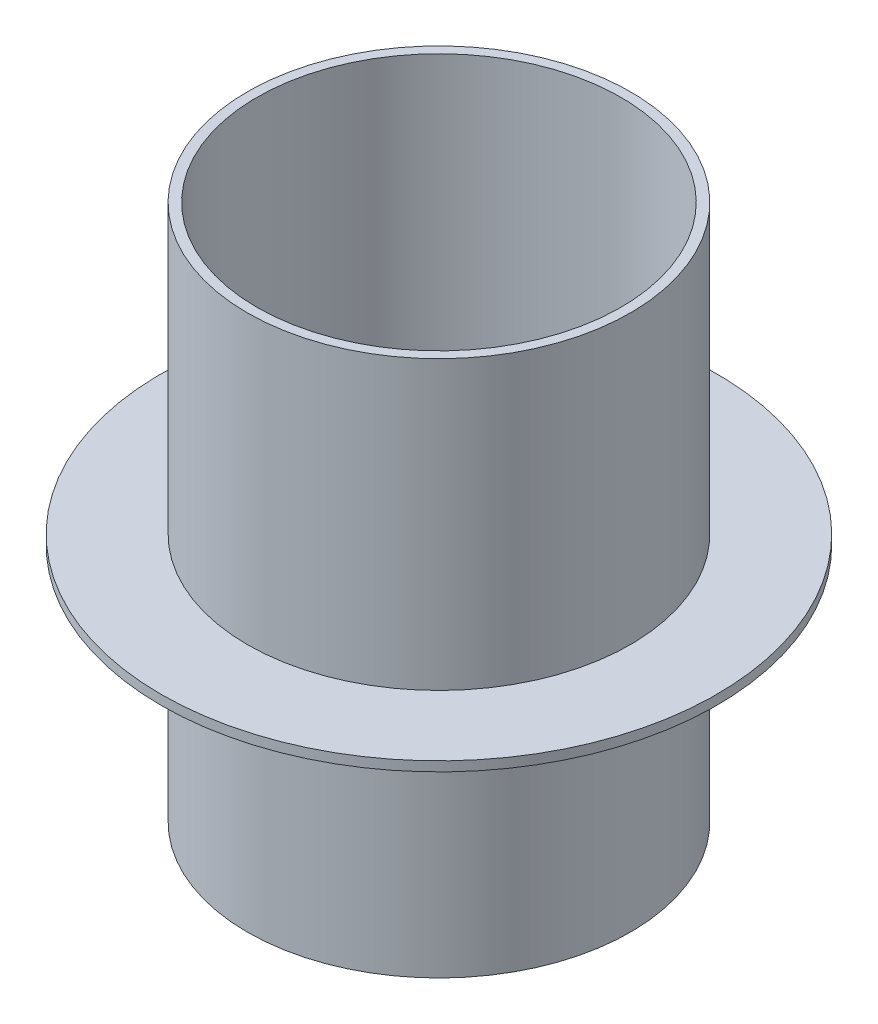
ISO-10303-21;
HEADER;
FILE_DESCRIPTION(('STEP AP214'),'2;1');
FILE_NAME('part.step','',(''),(''),'','','');
FILE_SCHEMA(('AUTOMOTIVE_DESIGN { 1 0 10303 214 1 1 1 1 }'));
ENDSEC;
DATA;
#1=APPLICATION_CONTEXT('core data for automotive mechanical design processes');
#2=APPLICATION_PROTOCOL_DEFINITION('international standard','automotive_design',2000,#1);
#3=PRODUCT_CONTEXT('',#1,'mechanical');
#4=PRODUCT('Part','Part','',(#3));
#5=PRODUCT_RELATED_PRODUCT_CATEGORY('part','',(#4));
#6=PRODUCT_DEFINITION_FORMATION('','',#4);
#7=PRODUCT_DEFINITION_CONTEXT('part definition',#1,'design');
#8=PRODUCT_DEFINITION('design','',#6,#7);
#9=PRODUCT_DEFINITION_SHAPE('','',#8);
#10=(LENGTH_UNIT() NAMED_UNIT(*) SI_UNIT(.MILLI.,.METRE.));
#11=(NAMED_UNIT(*) PLANE_ANGLE_UNIT() SI_UNIT($,.RADIAN.));
#12=(NAMED_UNIT(*) SI_UNIT($,.STERADIAN.) SOLID_ANGLE_UNIT());
#13=UNCERTAINTY_MEASURE_WITH_UNIT(LENGTH_MEASURE(1.E-05),#10,'distance_accuracy_value','');
#14=(GEOMETRIC_REPRESENTATION_CONTEXT(3) GLOBAL_UNCERTAINTY_ASSIGNED_CONTEXT((#13)) GLOBAL_UNIT_ASSIGNED_CONTEXT((#10,
#11,#12)) REPRESENTATION_CONTEXT('',''));
#15=CARTESIAN_POINT('',(0.,0.,0.));
#16=DIRECTION('',(0.,0.,1.));
#17=DIRECTION('',(1.,0.,0.));
#18=AXIS2_PLACEMENT_3D('',#15,#16,#17);
#19=CARTESIAN_POINT('',(38.,112.,0.));
#20=DIRECTION('',(0.,-1.,0.));
#21=DIRECTION('',(0.,0.,-1.));
#22=AXIS2_PLACEMENT_3D('',#19,#20,#21);
#23=PLANE('',#22);
#24=CARTESIAN_POINT('',(0.,112.,0.));
#25=DIRECTION('',(0.,1.,0.));
#26=DIRECTION('',(0.,0.,1.));
#27=AXIS2_PLACEMENT_3D('',#24,#25,#26);
#28=CIRCLE('',#27,38.);
#29=CARTESIAN_POINT('',(0.,112.,38.));
#30=VERTEX_POINT('',#29);
#31=EDGE_CURVE('E60',#30,#30,#28,.T.);
#32=ORIENTED_EDGE('',*,*,#31,.F.);
#33=EDGE_LOOP('',(#32));
#34=FACE_BOUND('',#33,.T.);
#35=CARTESIAN_POINT('',(0.,112.,0.));
#36=DIRECTION('',(0.,1.,0.));
#37=DIRECTION('',(0.,0.,1.));
#38=AXIS2_PLACEMENT_3D('',#35,#36,#37);
#39=CIRCLE('',#38,40.);
#40=CARTESIAN_POINT('',(0.,112.,40.));
#41=VERTEX_POINT('',#40);
#42=EDGE_CURVE('E10',#41,#41,#39,.T.);
#43=ORIENTED_EDGE('',*,*,#42,.T.);
#44=EDGE_LOOP('',(#43));
#45=FACE_BOUND('',#44,.T.);
#46=ADVANCED_FACE('F32',(#34,#45),#23,.F.);
#47=CARTESIAN_POINT('',(0.,71.2247582960843,0.));
#48=DIRECTION('',(0.,1.,0.));
#49=DIRECTION('',(0.,0.,1.));
#50=AXIS2_PLACEMENT_3D('',#47,#48,#49);
#51=CYLINDRICAL_SURFACE('',#50,40.);
#52=ORIENTED_EDGE('',*,*,#42,.F.);
#53=EDGE_LOOP('',(#52));
#54=FACE_BOUND('',#53,.T.);
#55=CARTESIAN_POINT('',(0.,52.,0.));
#56=DIRECTION('',(0.,1.,0.));
#57=DIRECTION('',(0.,0.,1.));
#58=AXIS2_PLACEMENT_3D('',#55,#56,#57);
#59=CIRCLE('',#58,40.);
#60=CARTESIAN_POINT('',(0.,52.,40.));
#61=VERTEX_POINT('',#60);
#62=EDGE_CURVE('E38',#61,#61,#59,.T.);
#63=ORIENTED_EDGE('',*,*,#62,.T.);
#64=EDGE_LOOP('',(#63));
#65=FACE_BOUND('',#64,.T.);
#66=ADVANCED_FACE('F67',(#54,#65),#51,.T.);
#67=CARTESIAN_POINT('',(40.,52.,0.));
#68=DIRECTION('',(0.,-1.,0.));
#69=DIRECTION('',(0.,0.,-1.));
#70=AXIS2_PLACEMENT_3D('',#67,#68,#69);
#71=PLANE('',#70);
#72=ORIENTED_EDGE('',*,*,#62,.F.);
#73=EDGE_LOOP('',(#72));
#74=FACE_BOUND('',#73,.T.);
#75=CARTESIAN_POINT('',(0.,52.,0.));
#76=DIRECTION('',(0.,1.,0.));
#77=DIRECTION('',(0.,0.,1.));
#78=AXIS2_PLACEMENT_3D('',#75,#76,#77);
#79=CIRCLE('',#78,58.);
#80=CARTESIAN_POINT('',(0.,52.,58.));
#81=VERTEX_POINT('',#80);
#82=EDGE_CURVE('E42',#81,#81,#79,.T.);
#83=ORIENTED_EDGE('',*,*,#82,.T.);
#84=EDGE_LOOP('',(#83));
#85=FACE_BOUND('',#84,.T.);
#86=ADVANCED_FACE('F71',(#74,#85),#71,.F.);
#87=CARTESIAN_POINT('',(0.,71.2247582960843,0.));
#88=DIRECTION('',(0.,1.,0.));
#89=DIRECTION('',(0.,0.,1.));
#90=AXIS2_PLACEMENT_3D('',#87,#88,#89);
#91=CYLINDRICAL_SURFACE('',#90,58.);
#92=ORIENTED_EDGE('',*,*,#82,.F.);
#93=EDGE_LOOP('',(#92));
#94=FACE_BOUND('',#93,.T.);
#95=CARTESIAN_POINT('',(0.,50.,0.));
#96=DIRECTION('',(0.,1.,0.));
#97=DIRECTION('',(0.,0.,1.));
#98=AXIS2_PLACEMENT_3D('',#95,#96,#97);
#99=CIRCLE('',#98,58.);
#100=CARTESIAN_POINT('',(0.,50.,58.));
#101=VERTEX_POINT('',#100);
#102=EDGE_CURVE('E46',#101,#101,#99,.T.);
#103=ORIENTED_EDGE('',*,*,#102,.T.);
#104=EDGE_LOOP('',(#103));
#105=FACE_BOUND('',#104,.T.);
#106=ADVANCED_FACE('F76',(#94,#105),#91,.T.);
#107=CARTESIAN_POINT('',(58.,50.,0.));
#108=DIRECTION('',(0.,1.,0.));
#109=DIRECTION('',(0.,0.,1.));
#110=AXIS2_PLACEMENT_3D('',#107,#108,#109);
#111=PLANE('',#110);
#112=ORIENTED_EDGE('',*,*,#102,.F.);
#113=EDGE_LOOP('',(#112));
#114=FACE_BOUND('',#113,.T.);
#115=CARTESIAN_POINT('',(0.,50.,0.));
#116=DIRECTION('',(0.,1.,0.));
#117=DIRECTION('',(0.,0.,1.));
#118=AXIS2_PLACEMENT_3D('',#115,#116,#117);
#119=CIRCLE('',#118,40.);
#120=CARTESIAN_POINT('',(0.,50.,40.));
#121=VERTEX_POINT('',#120);
#122=EDGE_CURVE('E51',#121,#121,#119,.T.);
#123=ORIENTED_EDGE('',*,*,#122,.T.);
#124=EDGE_LOOP('',(#123));
#125=FACE_BOUND('',#124,.T.);
#126=ADVANCED_FACE('F82',(#114,#125),#111,.F.);
#127=CARTESIAN_POINT('',(0.,71.2247582960843,0.));
#128=DIRECTION('',(0.,1.,0.));
#129=DIRECTION('',(0.,0.,1.));
#130=AXIS2_PLACEMENT_3D('',#127,#128,#129);
#131=CYLINDRICAL_SURFACE('',#130,40.);
#132=ORIENTED_EDGE('',*,*,#122,.F.);
#133=EDGE_LOOP('',(#132));
#134=FACE_BOUND('',#133,.T.);
#135=CARTESIAN_POINT('',(0.,0.,0.));
#136=DIRECTION('',(0.,1.,0.));
#137=DIRECTION('',(0.,0.,1.));
#138=AXIS2_PLACEMENT_3D('',#135,#136,#137);
#139=CIRCLE('',#138,40.);
#140=CARTESIAN_POINT('',(0.,0.,40.));
#141=VERTEX_POINT('',#140);
#142=EDGE_CURVE('E54',#141,#141,#139,.T.);
#143=ORIENTED_EDGE('',*,*,#142,.T.);
#144=EDGE_LOOP('',(#143));
#145=FACE_BOUND('',#144,.T.);
#146=ADVANCED_FACE('F86',(#134,#145),#131,.T.);
#147=CARTESIAN_POINT('',(40.,0.,0.));
#148=DIRECTION('',(0.,1.,0.));
#149=DIRECTION('',(0.,0.,1.));
#150=AXIS2_PLACEMENT_3D('',#147,#148,#149);
#151=PLANE('',#150);
#152=ORIENTED_EDGE('',*,*,#142,.F.);
#153=EDGE_LOOP('',(#152));
#154=FACE_BOUND('',#153,.T.);
#155=CARTESIAN_POINT('',(0.,0.,0.));
#156=DIRECTION('',(0.,1.,0.));
#157=DIRECTION('',(0.,0.,1.));
#158=AXIS2_PLACEMENT_3D('',#155,#156,#157);
#159=CIRCLE('',#158,38.);
#160=CARTESIAN_POINT('',(0.,0.,38.));
#161=VERTEX_POINT('',#160);
#162=EDGE_CURVE('E57',#161,#161,#159,.T.);
#163=ORIENTED_EDGE('',*,*,#162,.T.);
#164=EDGE_LOOP('',(#163));
#165=FACE_BOUND('',#164,.T.);
#166=ADVANCED_FACE('F90',(#154,#165),#151,.F.);
#167=CARTESIAN_POINT('',(0.,71.2247582960843,0.));
#168=DIRECTION('',(0.,1.,0.));
#169=DIRECTION('',(0.,0.,1.));
#170=AXIS2_PLACEMENT_3D('',#167,#168,#169);
#171=CYLINDRICAL_SURFACE('',#170,38.);
#172=ORIENTED_EDGE('',*,*,#162,.F.);
#173=EDGE_LOOP('',(#172));
#174=FACE_BOUND('',#173,.T.);
#175=ORIENTED_EDGE('',*,*,#31,.T.);
#176=EDGE_LOOP('',(#175));
#177=FACE_BOUND('',#176,.T.);
#178=ADVANCED_FACE('F64',(#174,#177),#171,.F.);
#179=CLOSED_SHELL('',(#46,#66,#86,#106,#126,#146,#166,#178));
#180=MANIFOLD_SOLID_BREP('B2',#179);
#181=ADVANCED_BREP_SHAPE_REPRESENTATION('',(#18,#180),#14);
#182=SHAPE_DEFINITION_REPRESENTATION(#9,#181);
ENDSEC;
END-ISO-10303-21;
